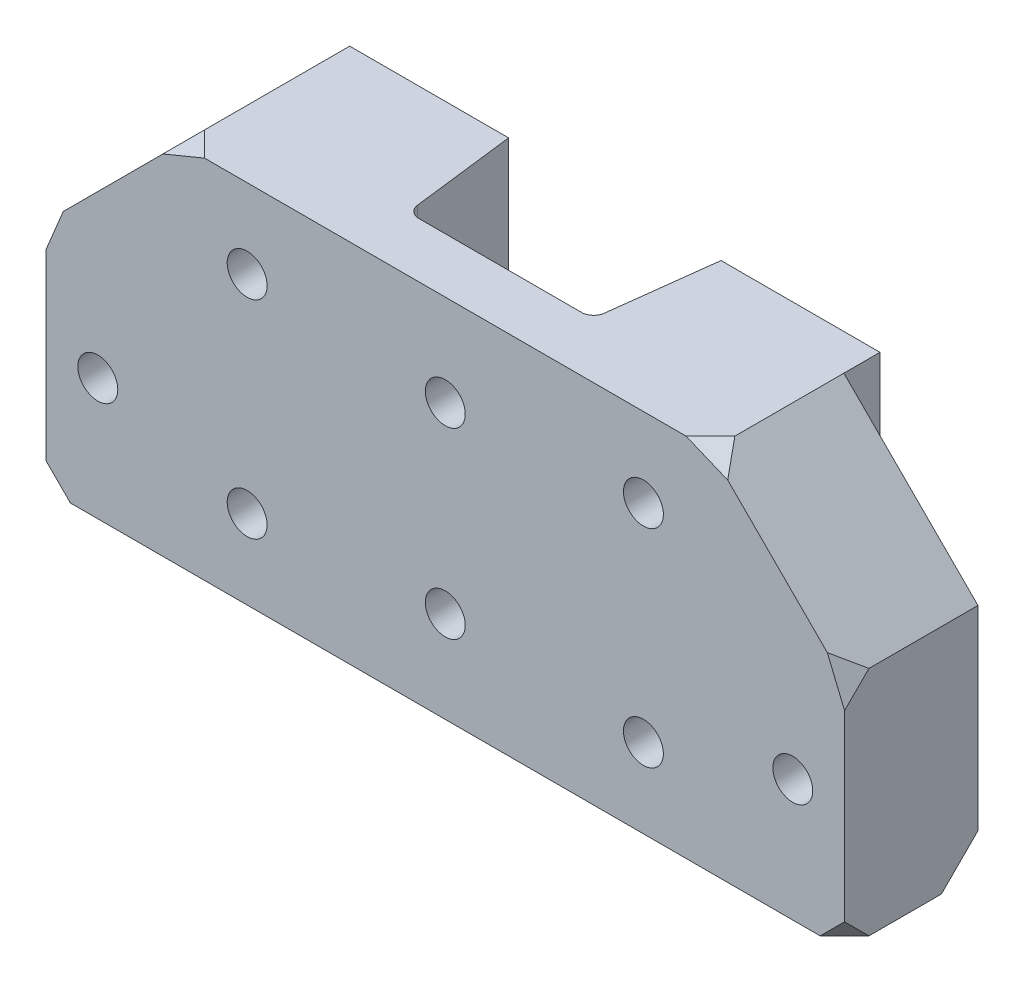
ISO-10303-21;
HEADER;
FILE_DESCRIPTION(('STEP AP214'),'2;1');
FILE_NAME('part.step','',(''),(''),'','','');
FILE_SCHEMA(('AUTOMOTIVE_DESIGN { 1 0 10303 214 1 1 1 1 }'));
ENDSEC;
DATA;
#1=APPLICATION_CONTEXT('core data for automotive mechanical design processes');
#2=APPLICATION_PROTOCOL_DEFINITION('international standard','automotive_design',2000,#1);
#3=PRODUCT_CONTEXT('',#1,'mechanical');
#4=PRODUCT('Part','Part','',(#3));
#5=PRODUCT_RELATED_PRODUCT_CATEGORY('part','',(#4));
#6=PRODUCT_DEFINITION_FORMATION('','',#4);
#7=PRODUCT_DEFINITION_CONTEXT('part definition',#1,'design');
#8=PRODUCT_DEFINITION('design','',#6,#7);
#9=PRODUCT_DEFINITION_SHAPE('','',#8);
#10=(LENGTH_UNIT() NAMED_UNIT(*) SI_UNIT(.MILLI.,.METRE.));
#11=(NAMED_UNIT(*) PLANE_ANGLE_UNIT() SI_UNIT($,.RADIAN.));
#12=(NAMED_UNIT(*) SI_UNIT($,.STERADIAN.) SOLID_ANGLE_UNIT());
#13=UNCERTAINTY_MEASURE_WITH_UNIT(LENGTH_MEASURE(1.E-05),#10,'distance_accuracy_value','');
#14=(GEOMETRIC_REPRESENTATION_CONTEXT(3) GLOBAL_UNCERTAINTY_ASSIGNED_CONTEXT((#13)) GLOBAL_UNIT_ASSIGNED_CONTEXT((#10,
#11,#12)) REPRESENTATION_CONTEXT('',''));
#15=CARTESIAN_POINT('',(0.,0.,0.));
#16=DIRECTION('',(0.,0.,1.));
#17=DIRECTION('',(1.,0.,0.));
#18=AXIS2_PLACEMENT_3D('',#15,#16,#17);
#19=CARTESIAN_POINT('',(84.1301615680965,38.,0.));
#20=DIRECTION('',(-0.707106781186547,-0.707106781186549,0.));
#21=DIRECTION('',(0.,0.,1.));
#22=AXIS2_PLACEMENT_3D('',#19,#20,#21);
#23=PLANE('',#22);
#24=DIRECTION('',(0.,0.,-1.));
#25=VECTOR('',#24,1.);
#26=CARTESIAN_POINT('',(62.1301615680964,60.,0.));
#27=LINE('',#26,#25);
#28=CARTESIAN_POINT('',(62.1301615680964,60.,33.626294368543));
#29=VERTEX_POINT('',#28);
#30=CARTESIAN_POINT('',(62.1301615680965,60.,15.7381471842715));
#31=VERTEX_POINT('',#30);
#32=EDGE_CURVE('E199',#29,#31,#27,.T.);
#33=ORIENTED_EDGE('',*,*,#32,.F.);
#34=DIRECTION('',(-0.5,0.499999999999999,-0.707106781186549));
#35=VECTOR('',#34,1.);
#36=CARTESIAN_POINT('',(61.2414711810105,60.8886903870859,32.3694963703755));
#37=LINE('',#36,#35);
#38=CARTESIAN_POINT('',(64.9585886928426,57.1715728752538,37.6262943685429));
#39=VERTEX_POINT('',#38);
#40=EDGE_CURVE('E11',#29,#39,#37,.F.);
#41=ORIENTED_EDGE('',*,*,#40,.T.);
#42=DIRECTION('',(0.707106781186549,-0.707106781186547,0.));
#43=VECTOR('',#42,1.);
#44=CARTESIAN_POINT('',(61.0650807840481,61.0650807840483,37.6262943685429));
#45=LINE('',#44,#43);
#46=CARTESIAN_POINT('',(81.3017344433502,40.8284271247462,37.6262943685429));
#47=VERTEX_POINT('',#46);
#48=EDGE_CURVE('E212',#47,#39,#45,.F.);
#49=ORIENTED_EDGE('',*,*,#48,.F.);
#50=DIRECTION('',(0.5,-0.499999999999999,-0.707106781186548));
#51=VECTOR('',#50,1.);
#52=CARTESIAN_POINT('',(96.0188519551823,26.1113096129142,16.8131471842714));
#53=LINE('',#52,#51);
#54=CARTESIAN_POINT('',(84.1301615680965,38.,33.6262943685429));
#55=VERTEX_POINT('',#54);
#56=EDGE_CURVE('E260',#55,#47,#53,.F.);
#57=ORIENTED_EDGE('',*,*,#56,.F.);
#58=DIRECTION('',(0.,0.,1.));
#59=VECTOR('',#58,1.);
#60=CARTESIAN_POINT('',(84.1301615680965,38.,0.));
#61=LINE('',#60,#59);
#62=CARTESIAN_POINT('',(84.1301615680965,38.,15.7381471842715));
#63=VERTEX_POINT('',#62);
#64=EDGE_CURVE('E226',#63,#55,#61,.T.);
#65=ORIENTED_EDGE('',*,*,#64,.F.);
#66=DIRECTION('',(-0.707106781186549,0.707106781186547,0.));
#67=VECTOR('',#66,1.);
#68=CARTESIAN_POINT('',(84.1301615680965,38.,15.7381471842715));
#69=LINE('',#68,#67);
#70=EDGE_CURVE('E207',#31,#63,#69,.F.);
#71=ORIENTED_EDGE('',*,*,#70,.F.);
#72=EDGE_LOOP('',(#33,#41,#49,#57,#65,#71));
#73=FACE_BOUND('',#72,.T.);
#74=ADVANCED_FACE('F40',(#73),#23,.F.);
#75=CARTESIAN_POINT('',(0.,0.,37.6262943685429));
#76=DIRECTION('',(0.,0.,1.));
#77=DIRECTION('',(1.,0.,0.));
#78=AXIS2_PLACEMENT_3D('',#75,#76,#77);
#79=PLANE('',#78);
#80=CARTESIAN_POINT('',(-38.3698384319035,20.,37.6262943685429));
#81=DIRECTION('',(0.,0.,1.));
#82=DIRECTION('',(1.,0.,0.));
#83=AXIS2_PLACEMENT_3D('',#80,#81,#82);
#84=CIRCLE('',#83,3.27500000000001);
#85=CARTESIAN_POINT('',(-35.0948384319035,20.,37.6262943685429));
#86=VERTEX_POINT('',#85);
#87=EDGE_CURVE('E547',#86,#86,#84,.T.);
#88=ORIENTED_EDGE('',*,*,#87,.F.);
#89=EDGE_LOOP('',(#88));
#90=FACE_BOUND('',#89,.T.);
#91=CARTESIAN_POINT('',(75.6301615680965,20.,37.6262943685429));
#92=DIRECTION('',(0.,0.,-1.));
#93=DIRECTION('',(-1.,0.,0.));
#94=AXIS2_PLACEMENT_3D('',#91,#92,#93);
#95=CIRCLE('',#94,3.27500000000001);
#96=CARTESIAN_POINT('',(72.3551615680965,20.,37.6262943685429));
#97=VERTEX_POINT('',#96);
#98=EDGE_CURVE('E491',#97,#97,#95,.T.);
#99=ORIENTED_EDGE('',*,*,#98,.T.);
#100=EDGE_LOOP('',(#99));
#101=FACE_BOUND('',#100,.T.);
#102=CARTESIAN_POINT('',(18.6301615680965,45.,37.6262943685429));
#103=DIRECTION('',(0.,0.,1.));
#104=DIRECTION('',(1.,0.,0.));
#105=AXIS2_PLACEMENT_3D('',#102,#103,#104);
#106=CIRCLE('',#105,3.275);
#107=CARTESIAN_POINT('',(21.9051615680965,45.,37.6262943685429));
#108=VERTEX_POINT('',#107);
#109=EDGE_CURVE('E503',#108,#108,#106,.T.);
#110=ORIENTED_EDGE('',*,*,#109,.F.);
#111=EDGE_LOOP('',(#110));
#112=FACE_BOUND('',#111,.T.);
#113=CARTESIAN_POINT('',(18.6301615680965,15.,37.6262943685429));
#114=DIRECTION('',(0.,0.,1.));
#115=DIRECTION('',(1.,0.,0.));
#116=AXIS2_PLACEMENT_3D('',#113,#114,#115);
#117=CIRCLE('',#116,3.275);
#118=CARTESIAN_POINT('',(21.9051615680965,15.,37.6262943685429));
#119=VERTEX_POINT('',#118);
#120=EDGE_CURVE('E502',#119,#119,#117,.T.);
#121=ORIENTED_EDGE('',*,*,#120,.F.);
#122=EDGE_LOOP('',(#121));
#123=FACE_BOUND('',#122,.T.);
#124=CARTESIAN_POINT('',(51.1301615680965,47.,37.6262943685429));
#125=DIRECTION('',(0.,0.,1.));
#126=DIRECTION('',(1.,0.,0.));
#127=AXIS2_PLACEMENT_3D('',#124,#125,#126);
#128=CIRCLE('',#127,3.275);
#129=CARTESIAN_POINT('',(54.4051615680965,47.,37.6262943685429));
#130=VERTEX_POINT('',#129);
#131=EDGE_CURVE('E517',#130,#130,#128,.T.);
#132=ORIENTED_EDGE('',*,*,#131,.F.);
#133=EDGE_LOOP('',(#132));
#134=FACE_BOUND('',#133,.T.);
#135=CARTESIAN_POINT('',(-13.8698384319035,47.,37.6262943685429));
#136=DIRECTION('',(0.,0.,1.));
#137=DIRECTION('',(1.,0.,0.));
#138=AXIS2_PLACEMENT_3D('',#135,#136,#137);
#139=CIRCLE('',#138,3.275);
#140=CARTESIAN_POINT('',(-10.5948384319035,47.,37.6262943685429));
#141=VERTEX_POINT('',#140);
#142=EDGE_CURVE('E523',#141,#141,#139,.T.);
#143=ORIENTED_EDGE('',*,*,#142,.F.);
#144=EDGE_LOOP('',(#143));
#145=FACE_BOUND('',#144,.T.);
#146=CARTESIAN_POINT('',(-13.8698384319035,13.,37.6262943685429));
#147=DIRECTION('',(0.,0.,1.));
#148=DIRECTION('',(1.,0.,0.));
#149=AXIS2_PLACEMENT_3D('',#146,#147,#148);
#150=CIRCLE('',#149,3.275);
#151=CARTESIAN_POINT('',(-10.5948384319035,13.,37.6262943685429));
#152=VERTEX_POINT('',#151);
#153=EDGE_CURVE('E520',#152,#152,#150,.T.);
#154=ORIENTED_EDGE('',*,*,#153,.F.);
#155=EDGE_LOOP('',(#154));
#156=FACE_BOUND('',#155,.T.);
#157=CARTESIAN_POINT('',(51.1301615680965,13.,37.6262943685429));
#158=DIRECTION('',(0.,0.,1.));
#159=DIRECTION('',(1.,0.,0.));
#160=AXIS2_PLACEMENT_3D('',#157,#158,#159);
#161=CIRCLE('',#160,3.275);
#162=CARTESIAN_POINT('',(54.4051615680965,13.,37.6262943685429));
#163=VERTEX_POINT('',#162);
#164=EDGE_CURVE('E514',#163,#163,#161,.T.);
#165=ORIENTED_EDGE('',*,*,#164,.F.);
#166=EDGE_LOOP('',(#165));
#167=FACE_BOUND('',#166,.T.);
#168=ORIENTED_EDGE('',*,*,#48,.T.);
#169=DIRECTION('',(-0.923879532511287,0.382683432365089,0.));
#170=VECTOR('',#169,1.);
#171=CARTESIAN_POINT('',(29.7261685015092,71.7653191537318,37.6262943685429));
#172=LINE('',#171,#170);
#173=CARTESIAN_POINT('',(58.1301615680964,60.,37.6262943685429));
#174=VERTEX_POINT('',#173);
#175=EDGE_CURVE('E48',#39,#174,#172,.T.);
#176=ORIENTED_EDGE('',*,*,#175,.T.);
#177=DIRECTION('',(-1.,0.,0.));
#178=VECTOR('',#177,1.);
#179=CARTESIAN_POINT('',(62.1301615680965,60.,37.6262943685429));
#180=LINE('',#179,#178);
#181=CARTESIAN_POINT('',(-20.8698384319036,60.,37.6262943685429));
#182=VERTEX_POINT('',#181);
#183=EDGE_CURVE('E60',#174,#182,#180,.T.);
#184=ORIENTED_EDGE('',*,*,#183,.T.);
#185=DIRECTION('',(0.923879532511287,0.38268343236509,0.));
#186=VECTOR('',#185,1.);
#187=CARTESIAN_POINT('',(-24.2695205128149,58.5918055743298,37.6262943685429));
#188=LINE('',#187,#186);
#189=CARTESIAN_POINT('',(-27.6982655566497,57.1715728752538,37.6262943685429));
#190=VERTEX_POINT('',#189);
#191=EDGE_CURVE('E281',#190,#182,#188,.T.);
#192=ORIENTED_EDGE('',*,*,#191,.F.);
#193=DIRECTION('',(0.707106781186547,0.707106781186548,0.));
#194=VECTOR('',#193,1.);
#195=CARTESIAN_POINT('',(-42.4349192159518,42.4349192159517,37.6262943685429));
#196=LINE('',#195,#194);
#197=CARTESIAN_POINT('',(-44.0414113071573,40.8284271247462,37.6262943685429));
#198=VERTEX_POINT('',#197);
#199=EDGE_CURVE('E219',#190,#198,#196,.F.);
#200=ORIENTED_EDGE('',*,*,#199,.T.);
#201=DIRECTION('',(-0.382683432365089,-0.923879532511287,0.));
#202=VECTOR('',#201,1.);
#203=CARTESIAN_POINT('',(-52.0267247902815,21.550175013987,37.6262943685429));
#204=LINE('',#203,#202);
#205=CARTESIAN_POINT('',(-46.8698384319035,34.,37.6262943685429));
#206=VERTEX_POINT('',#205);
#207=EDGE_CURVE('E247',#198,#206,#204,.T.);
#208=ORIENTED_EDGE('',*,*,#207,.T.);
#209=DIRECTION('',(0.,-1.,0.));
#210=VECTOR('',#209,1.);
#211=CARTESIAN_POINT('',(-46.8698384319035,0.,37.6262943685429));
#212=LINE('',#211,#210);
#213=CARTESIAN_POINT('',(-46.8698384319035,3.99999999999999,37.6262943685429));
#214=VERTEX_POINT('',#213);
#215=EDGE_CURVE('E546',#206,#214,#212,.T.);
#216=ORIENTED_EDGE('',*,*,#215,.T.);
#217=DIRECTION('',(0.707106781186548,-0.707106781186547,0.));
#218=VECTOR('',#217,1.);
#219=CARTESIAN_POINT('',(-21.4349192159518,-21.4349192159518,37.6262943685429));
#220=LINE('',#219,#218);
#221=CARTESIAN_POINT('',(-42.8698384319035,0.,37.6262943685429));
#222=VERTEX_POINT('',#221);
#223=EDGE_CURVE('E239',#214,#222,#220,.T.);
#224=ORIENTED_EDGE('',*,*,#223,.T.);
#225=DIRECTION('',(1.,0.,0.));
#226=VECTOR('',#225,1.);
#227=CARTESIAN_POINT('',(-24.8698384319035,0.,37.6262943685429));
#228=LINE('',#227,#226);
#229=CARTESIAN_POINT('',(80.1301615680965,0.,37.6262943685429));
#230=VERTEX_POINT('',#229);
#231=EDGE_CURVE('E526',#222,#230,#228,.T.);
#232=ORIENTED_EDGE('',*,*,#231,.T.);
#233=DIRECTION('',(0.707106781186548,0.707106781186547,0.));
#234=VECTOR('',#233,1.);
#235=CARTESIAN_POINT('',(40.0650807840482,-40.0650807840482,37.6262943685429));
#236=LINE('',#235,#234);
#237=CARTESIAN_POINT('',(84.1301615680965,4.00000000000002,37.626294368543));
#238=VERTEX_POINT('',#237);
#239=EDGE_CURVE('E233',#230,#238,#236,.T.);
#240=ORIENTED_EDGE('',*,*,#239,.T.);
#241=DIRECTION('',(0.,-1.,0.));
#242=VECTOR('',#241,1.);
#243=CARTESIAN_POINT('',(84.1301615680965,0.,37.6262943685429));
#244=LINE('',#243,#242);
#245=CARTESIAN_POINT('',(84.1301615680965,34.,37.6262943685429));
#246=VERTEX_POINT('',#245);
#247=EDGE_CURVE('E490',#246,#238,#244,.T.);
#248=ORIENTED_EDGE('',*,*,#247,.F.);
#249=DIRECTION('',(0.38268343236509,-0.923879532511287,0.));
#250=VECTOR('',#249,1.);
#251=CARTESIAN_POINT('',(83.83039993778,34.7236885933891,37.6262943685429));
#252=LINE('',#251,#250);
#253=EDGE_CURVE('E255',#47,#246,#252,.T.);
#254=ORIENTED_EDGE('',*,*,#253,.F.);
#255=EDGE_LOOP('',(#168,#176,#184,#192,#200,#208,#216,#224,#232,#240,#248,#254));
#256=FACE_BOUND('',#255,.T.);
#257=ADVANCED_FACE('F283',(#90,#101,#112,#123,#134,#145,#156,#167,#256),#79,.T.);
#258=CARTESIAN_POINT('',(0.,60.,0.));
#259=DIRECTION('',(0.,-1.,0.));
#260=DIRECTION('',(0.,0.,-1.));
#261=AXIS2_PLACEMENT_3D('',#258,#259,#260);
#262=PLANE('',#261);
#263=DIRECTION('',(-0.707106781186548,0.,0.707106781186548));
#264=VECTOR('',#263,1.);
#265=CARTESIAN_POINT('',(47.8782279683197,60.,47.8782279683197));
#266=LINE('',#265,#264);
#267=EDGE_CURVE('E193',#29,#174,#266,.T.);
#268=ORIENTED_EDGE('',*,*,#267,.F.);
#269=ORIENTED_EDGE('',*,*,#32,.T.);
#270=DIRECTION('',(0.,0.,-1.));
#271=VECTOR('',#270,1.);
#272=CARTESIAN_POINT('',(62.1301615680965,60.,95.5324756032248));
#273=LINE('',#272,#271);
#274=CARTESIAN_POINT('',(62.1301615680965,60.,9.81314718427147));
#275=VERTEX_POINT('',#274);
#276=EDGE_CURVE('E415',#31,#275,#273,.T.);
#277=ORIENTED_EDGE('',*,*,#276,.T.);
#278=DIRECTION('',(1.,0.,0.));
#279=VECTOR('',#278,1.);
#280=CARTESIAN_POINT('',(-2.86983843190352,60.,9.81314718427147));
#281=LINE('',#280,#279);
#282=CARTESIAN_POINT('',(36.0554201680968,60.,9.81314718427147));
#283=VERTEX_POINT('',#282);
#284=EDGE_CURVE('E418',#283,#275,#281,.T.);
#285=ORIENTED_EDGE('',*,*,#284,.F.);
#286=DIRECTION('',(-0.121869343405151,0.,0.992546151641322));
#287=VECTOR('',#286,1.);
#288=CARTESIAN_POINT('',(36.970576623517,60.0000000000001,2.35979597553153));
#289=LINE('',#288,#287);
#290=CARTESIAN_POINT('',(33.961097926045,60.0000000000001,26.8700330553532));
#291=VERTEX_POINT('',#290);
#292=EDGE_CURVE('E439',#283,#291,#289,.T.);
#293=ORIENTED_EDGE('',*,*,#292,.T.);
#294=CARTESIAN_POINT('',(31.9760056227623,60.0000000000001,26.6262943685429));
#295=DIRECTION('',(0.,-1.,0.));
#296=DIRECTION('',(0.,0.,-1.));
#297=AXIS2_PLACEMENT_3D('',#294,#295,#296);
#298=CIRCLE('',#297,2.);
#299=CARTESIAN_POINT('',(31.9760056227623,60.0000000000001,28.626294368543));
#300=VERTEX_POINT('',#299);
#301=EDGE_CURVE('E441',#291,#300,#298,.T.);
#302=ORIENTED_EDGE('',*,*,#301,.T.);
#303=DIRECTION('',(-1.,0.,0.));
#304=VECTOR('',#303,1.);
#305=CARTESIAN_POINT('',(5.28431751343065,60.0000000000001,28.6262943685429));
#306=LINE('',#305,#304);
#307=CARTESIAN_POINT('',(5.28431751343065,60.0000000000001,28.6262943685429));
#308=VERTEX_POINT('',#307);
#309=EDGE_CURVE('E444',#300,#308,#306,.T.);
#310=ORIENTED_EDGE('',*,*,#309,.T.);
#311=CARTESIAN_POINT('',(5.28431751343064,60.0000000000001,26.6262943685429));
#312=DIRECTION('',(0.,-1.,0.));
#313=DIRECTION('',(0.,0.,-1.));
#314=AXIS2_PLACEMENT_3D('',#311,#312,#313);
#315=CIRCLE('',#314,2.);
#316=CARTESIAN_POINT('',(3.29922521014799,60.0000000000001,26.8700330553532));
#317=VERTEX_POINT('',#316);
#318=EDGE_CURVE('E447',#308,#317,#315,.T.);
#319=ORIENTED_EDGE('',*,*,#318,.T.);
#320=DIRECTION('',(-0.121869343405144,0.,-0.992546151641323));
#321=VECTOR('',#320,1.);
#322=CARTESIAN_POINT('',(0.298191513608607,60.0000000000001,2.42857498871066));
#323=LINE('',#322,#321);
#324=CARTESIAN_POINT('',(1.20490296809632,60.0000000000001,9.81314718427148));
#325=VERTEX_POINT('',#324);
#326=EDGE_CURVE('E450',#317,#325,#323,.T.);
#327=ORIENTED_EDGE('',*,*,#326,.T.);
#328=CARTESIAN_POINT('',(-24.8698384319035,60.,9.81314718427147));
#329=VERTEX_POINT('',#328);
#330=EDGE_CURVE('E395',#329,#325,#281,.T.);
#331=ORIENTED_EDGE('',*,*,#330,.F.);
#332=DIRECTION('',(0.,0.,-1.));
#333=VECTOR('',#332,1.);
#334=CARTESIAN_POINT('',(-24.8698384319035,60.,95.5324756032248));
#335=LINE('',#334,#333);
#336=CARTESIAN_POINT('',(-24.8698384319035,60.,15.7381471842715));
#337=VERTEX_POINT('',#336);
#338=EDGE_CURVE('E393',#337,#329,#335,.T.);
#339=ORIENTED_EDGE('',*,*,#338,.F.);
#340=DIRECTION('',(0.,0.,1.));
#341=VECTOR('',#340,1.);
#342=CARTESIAN_POINT('',(-24.8698384319035,60.,0.));
#343=LINE('',#342,#341);
#344=CARTESIAN_POINT('',(-24.8698384319035,60.,33.626294368543));
#345=VERTEX_POINT('',#344);
#346=EDGE_CURVE('E208',#337,#345,#343,.T.);
#347=ORIENTED_EDGE('',*,*,#346,.T.);
#348=DIRECTION('',(0.707106781186548,0.,0.707106781186547));
#349=VECTOR('',#348,1.);
#350=CARTESIAN_POINT('',(-29.2480664002233,60.,29.2480664002233));
#351=LINE('',#350,#349);
#352=EDGE_CURVE('E202',#345,#182,#351,.T.);
#353=ORIENTED_EDGE('',*,*,#352,.T.);
#354=ORIENTED_EDGE('',*,*,#183,.F.);
#355=EDGE_LOOP('',(#268,#269,#277,#285,#293,#302,#310,#319,#327,#331,#339,#347,#353,#354));
#356=FACE_BOUND('',#355,.T.);
#357=ADVANCED_FACE('F198',(#356),#262,.F.);
#358=CARTESIAN_POINT('',(-46.8698384319035,0.,15.7381471842715));
#359=DIRECTION('',(0.,0.,-1.));
#360=DIRECTION('',(-1.,0.,0.));
#361=AXIS2_PLACEMENT_3D('',#358,#359,#360);
#362=PLANE('',#361);
#363=CARTESIAN_POINT('',(-38.3698384319035,20.,15.7381471842715));
#364=DIRECTION('',(0.,0.,1.));
#365=DIRECTION('',(1.,0.,0.));
#366=AXIS2_PLACEMENT_3D('',#363,#364,#365);
#367=CIRCLE('',#366,3.27500000000001);
#368=CARTESIAN_POINT('',(-35.0948384319035,20.,15.7381471842715));
#369=VERTEX_POINT('',#368);
#370=EDGE_CURVE('E552',#369,#369,#367,.T.);
#371=ORIENTED_EDGE('',*,*,#370,.T.);
#372=EDGE_LOOP('',(#371));
#373=FACE_BOUND('',#372,.T.);
#374=DIRECTION('',(1.,0.,0.));
#375=VECTOR('',#374,1.);
#376=CARTESIAN_POINT('',(-46.8698384319035,0.,15.7381471842715));
#377=LINE('',#376,#375);
#378=CARTESIAN_POINT('',(-40.8698384319035,0.,15.7381471842715));
#379=VERTEX_POINT('',#378);
#380=CARTESIAN_POINT('',(-24.8698384319035,0.,15.7381471842715));
#381=VERTEX_POINT('',#380);
#382=EDGE_CURVE('E540',#379,#381,#377,.T.);
#383=ORIENTED_EDGE('',*,*,#382,.F.);
#384=DIRECTION('',(-0.707106781186547,0.707106781186548,0.));
#385=VECTOR('',#384,1.);
#386=CARTESIAN_POINT('',(-43.8698384319035,3.00000000000002,15.7381471842715));
#387=LINE('',#386,#385);
#388=CARTESIAN_POINT('',(-46.8698384319035,6.00000000000002,15.7381471842715));
#389=VERTEX_POINT('',#388);
#390=EDGE_CURVE('E273',#379,#389,#387,.T.);
#391=ORIENTED_EDGE('',*,*,#390,.T.);
#392=DIRECTION('',(0.,1.,0.));
#393=VECTOR('',#392,1.);
#394=CARTESIAN_POINT('',(-46.8698384319035,0.,15.7381471842715));
#395=LINE('',#394,#393);
#396=CARTESIAN_POINT('',(-46.8698384319035,38.,15.7381471842715));
#397=VERTEX_POINT('',#396);
#398=EDGE_CURVE('E549',#389,#397,#395,.T.);
#399=ORIENTED_EDGE('',*,*,#398,.T.);
#400=DIRECTION('',(-0.707106781186547,-0.707106781186548,0.));
#401=VECTOR('',#400,1.);
#402=CARTESIAN_POINT('',(-65.8698384319035,19.,15.7381471842715));
#403=LINE('',#402,#401);
#404=EDGE_CURVE('E224',#397,#337,#403,.F.);
#405=ORIENTED_EDGE('',*,*,#404,.T.);
#406=DIRECTION('',(0.,1.,0.));
#407=VECTOR('',#406,1.);
#408=CARTESIAN_POINT('',(-24.8698384319035,0.,15.7381471842715));
#409=LINE('',#408,#407);
#410=EDGE_CURVE('E538',#381,#337,#409,.T.);
#411=ORIENTED_EDGE('',*,*,#410,.F.);
#412=EDGE_LOOP('',(#383,#391,#399,#405,#411));
#413=FACE_BOUND('',#412,.T.);
#414=ADVANCED_FACE('F316',(#373,#413),#362,.T.);
#415=CARTESIAN_POINT('',(12.657693959334,0.,2.96357615590343));
#416=DIRECTION('',(0.,-1.,0.));
#417=DIRECTION('',(0.,0.,-1.));
#418=AXIS2_PLACEMENT_3D('',#415,#416,#417);
#419=PLANE('',#418);
#420=DIRECTION('',(0.,0.,-1.));
#421=VECTOR('',#420,1.);
#422=CARTESIAN_POINT('',(-46.8698384319035,0.,37.6262943685429));
#423=LINE('',#422,#421);
#424=CARTESIAN_POINT('',(-46.8698384319035,0.,33.626294368543));
#425=VERTEX_POINT('',#424);
#426=CARTESIAN_POINT('',(-46.8698384319035,0.,21.7381471842715));
#427=VERTEX_POINT('',#426);
#428=EDGE_CURVE('E544',#425,#427,#423,.T.);
#429=ORIENTED_EDGE('',*,*,#428,.T.);
#430=DIRECTION('',(0.707106781186548,0.,-0.707106781186548));
#431=VECTOR('',#430,1.);
#432=CARTESIAN_POINT('',(-7.71878672210072,0.,-17.4129045255313));
#433=LINE('',#432,#431);
#434=EDGE_CURVE('E271',#427,#379,#433,.T.);
#435=ORIENTED_EDGE('',*,*,#434,.T.);
#436=ORIENTED_EDGE('',*,*,#382,.T.);
#437=DIRECTION('',(0.,0.,-1.));
#438=VECTOR('',#437,1.);
#439=CARTESIAN_POINT('',(-24.8698384319035,0.,95.5324756032248));
#440=LINE('',#439,#438);
#441=CARTESIAN_POINT('',(-24.8698384319035,0.,9.81314718427147));
#442=VERTEX_POINT('',#441);
#443=EDGE_CURVE('E400',#381,#442,#440,.T.);
#444=ORIENTED_EDGE('',*,*,#443,.T.);
#445=DIRECTION('',(1.,0.,0.));
#446=VECTOR('',#445,1.);
#447=CARTESIAN_POINT('',(-2.86983843190352,0.,9.81314718427147));
#448=LINE('',#447,#446);
#449=CARTESIAN_POINT('',(1.20490296809632,0.,9.81314718427147));
#450=VERTEX_POINT('',#449);
#451=EDGE_CURVE('E420',#442,#450,#448,.T.);
#452=ORIENTED_EDGE('',*,*,#451,.T.);
#453=DIRECTION('',(0.121869343405145,0.,0.992546151641322));
#454=VECTOR('',#453,1.);
#455=CARTESIAN_POINT('',(0.298191513608603,0.,2.42857498871065));
#456=LINE('',#455,#454);
#457=CARTESIAN_POINT('',(3.29922521014799,0.,26.8700330553532));
#458=VERTEX_POINT('',#457);
#459=EDGE_CURVE('E214',#450,#458,#456,.T.);
#460=ORIENTED_EDGE('',*,*,#459,.T.);
#461=CARTESIAN_POINT('',(5.28431751343064,0.,26.6262943685429));
#462=DIRECTION('',(0.,-1.,0.));
#463=DIRECTION('',(0.,0.,-1.));
#464=AXIS2_PLACEMENT_3D('',#461,#462,#463);
#465=CIRCLE('',#464,2.);
#466=CARTESIAN_POINT('',(5.28431751343065,0.,28.6262943685429));
#467=VERTEX_POINT('',#466);
#468=EDGE_CURVE('E461',#458,#467,#465,.F.);
#469=ORIENTED_EDGE('',*,*,#468,.T.);
#470=DIRECTION('',(1.,0.,0.));
#471=VECTOR('',#470,1.);
#472=CARTESIAN_POINT('',(12.657693959334,0.,28.6262943685429));
#473=LINE('',#472,#471);
#474=CARTESIAN_POINT('',(31.9760056227623,0.,28.626294368543));
#475=VERTEX_POINT('',#474);
#476=EDGE_CURVE('E458',#467,#475,#473,.T.);
#477=ORIENTED_EDGE('',*,*,#476,.T.);
#478=CARTESIAN_POINT('',(31.9760056227623,0.,26.6262943685429));
#479=DIRECTION('',(0.,-1.,0.));
#480=DIRECTION('',(0.,0.,-1.));
#481=AXIS2_PLACEMENT_3D('',#478,#479,#480);
#482=CIRCLE('',#481,2.00000000000001);
#483=CARTESIAN_POINT('',(33.961097926045,0.,26.8700330553532));
#484=VERTEX_POINT('',#483);
#485=EDGE_CURVE('E455',#475,#484,#482,.F.);
#486=ORIENTED_EDGE('',*,*,#485,.T.);
#487=DIRECTION('',(0.121869343405151,0.,-0.992546151641322));
#488=VECTOR('',#487,1.);
#489=CARTESIAN_POINT('',(33.961097926045,0.,26.8700330553533));
#490=LINE('',#489,#488);
#491=CARTESIAN_POINT('',(36.0554201680968,0.,9.81314718427147));
#492=VERTEX_POINT('',#491);
#493=EDGE_CURVE('E452',#484,#492,#490,.T.);
#494=ORIENTED_EDGE('',*,*,#493,.T.);
#495=CARTESIAN_POINT('',(62.1301615680965,0.,9.81314718427147));
#496=VERTEX_POINT('',#495);
#497=EDGE_CURVE('E424',#492,#496,#448,.T.);
#498=ORIENTED_EDGE('',*,*,#497,.T.);
#499=DIRECTION('',(0.,0.,-1.));
#500=VECTOR('',#499,1.);
#501=CARTESIAN_POINT('',(62.1301615680965,0.,95.5324756032248));
#502=LINE('',#501,#500);
#503=CARTESIAN_POINT('',(62.1301615680965,0.,15.7381471842715));
#504=VERTEX_POINT('',#503);
#505=EDGE_CURVE('E416',#504,#496,#502,.T.);
#506=ORIENTED_EDGE('',*,*,#505,.F.);
#507=DIRECTION('',(-1.,0.,0.));
#508=VECTOR('',#507,1.);
#509=CARTESIAN_POINT('',(84.1301615680965,0.,15.7381471842715));
#510=LINE('',#509,#508);
#511=CARTESIAN_POINT('',(78.1301615680965,0.,15.7381471842715));
#512=VERTEX_POINT('',#511);
#513=EDGE_CURVE('E489',#512,#504,#510,.T.);
#514=ORIENTED_EDGE('',*,*,#513,.F.);
#515=DIRECTION('',(0.707106781186548,0.,0.707106781186547));
#516=VECTOR('',#515,1.);
#517=CARTESIAN_POINT('',(39.0066422495311,0.,-23.3853721342938));
#518=LINE('',#517,#516);
#519=CARTESIAN_POINT('',(84.1301615680965,0.,21.7381471842715));
#520=VERTEX_POINT('',#519);
#521=EDGE_CURVE('E266',#512,#520,#518,.T.);
#522=ORIENTED_EDGE('',*,*,#521,.T.);
#523=DIRECTION('',(0.,0.,-1.));
#524=VECTOR('',#523,1.);
#525=CARTESIAN_POINT('',(84.1301615680965,0.,37.6262943685429));
#526=LINE('',#525,#524);
#527=CARTESIAN_POINT('',(84.1301615680965,0.,33.6262943685429));
#528=VERTEX_POINT('',#527);
#529=EDGE_CURVE('E493',#528,#520,#526,.T.);
#530=ORIENTED_EDGE('',*,*,#529,.F.);
#531=DIRECTION('',(-0.707106781186548,0.,0.707106781186547));
#532=VECTOR('',#531,1.);
#533=CARTESIAN_POINT('',(63.7252868700349,0.,54.0311690666044));
#534=LINE('',#533,#532);
#535=EDGE_CURVE('E230',#528,#230,#534,.T.);
#536=ORIENTED_EDGE('',*,*,#535,.T.);
#537=ORIENTED_EDGE('',*,*,#231,.F.);
#538=DIRECTION('',(-0.707106781186548,0.,-0.707106781186547));
#539=VECTOR('',#538,1.);
#540=CARTESIAN_POINT('',(-32.4374313426045,0.,48.058701457842));
#541=LINE('',#540,#539);
#542=EDGE_CURVE('E241',#222,#425,#541,.T.);
#543=ORIENTED_EDGE('',*,*,#542,.T.);
#544=EDGE_LOOP('',(#429,#435,#436,#444,#452,#460,#469,#477,#486,#494,#498,#506,#514,#522,#530,
#536,#537,#543));
#545=FACE_BOUND('',#544,.T.);
#546=ADVANCED_FACE('F374',(#545),#419,.T.);
#547=CARTESIAN_POINT('',(84.1301615680965,0.,0.));
#548=DIRECTION('',(-1.,0.,0.));
#549=DIRECTION('',(0.,0.,1.));
#550=AXIS2_PLACEMENT_3D('',#547,#548,#549);
#551=PLANE('',#550);
#552=DIRECTION('',(0.,-0.707106781186548,0.707106781186547));
#553=VECTOR('',#552,1.);
#554=CARTESIAN_POINT('',(84.1301615680965,10.8690735921357,10.8690735921357));
#555=LINE('',#554,#553);
#556=CARTESIAN_POINT('',(84.1301615680965,6.,15.7381471842715));
#557=VERTEX_POINT('',#556);
#558=EDGE_CURVE('E263',#557,#520,#555,.T.);
#559=ORIENTED_EDGE('',*,*,#558,.F.);
#560=DIRECTION('',(0.,1.,0.));
#561=VECTOR('',#560,1.);
#562=CARTESIAN_POINT('',(84.1301615680965,0.,15.7381471842715));
#563=LINE('',#562,#561);
#564=EDGE_CURVE('E291',#557,#63,#563,.T.);
#565=ORIENTED_EDGE('',*,*,#564,.T.);
#566=ORIENTED_EDGE('',*,*,#64,.T.);
#567=DIRECTION('',(0.,-0.707106781186548,0.707106781186547));
#568=VECTOR('',#567,1.);
#569=CARTESIAN_POINT('',(84.1301615680965,35.8131471842714,35.8131471842715));
#570=LINE('',#569,#568);
#571=EDGE_CURVE('E258',#55,#246,#570,.T.);
#572=ORIENTED_EDGE('',*,*,#571,.T.);
#573=ORIENTED_EDGE('',*,*,#247,.T.);
#574=DIRECTION('',(0.,0.707106781186548,0.707106781186547));
#575=VECTOR('',#574,1.);
#576=CARTESIAN_POINT('',(84.1301615680965,-16.8131471842715,16.8131471842715));
#577=LINE('',#576,#575);
#578=EDGE_CURVE('E236',#528,#238,#577,.T.);
#579=ORIENTED_EDGE('',*,*,#578,.F.);
#580=ORIENTED_EDGE('',*,*,#529,.T.);
#581=EDGE_LOOP('',(#559,#565,#566,#572,#573,#579,#580));
#582=FACE_BOUND('',#581,.T.);
#583=ADVANCED_FACE('F290',(#582),#551,.F.);
#584=CARTESIAN_POINT('',(-24.8698384319035,60.,0.));
#585=DIRECTION('',(0.707106781186548,-0.707106781186547,0.));
#586=DIRECTION('',(0.,0.,1.));
#587=AXIS2_PLACEMENT_3D('',#584,#585,#586);
#588=PLANE('',#587);
#589=DIRECTION('',(0.499999999999999,0.5,-0.707106781186548));
#590=VECTOR('',#589,1.);
#591=CARTESIAN_POINT('',(-12.9811480448176,71.8886903870859,16.8131471842715));
#592=LINE('',#591,#590);
#593=EDGE_CURVE('E279',#345,#190,#592,.F.);
#594=ORIENTED_EDGE('',*,*,#593,.F.);
#595=ORIENTED_EDGE('',*,*,#346,.F.);
#596=ORIENTED_EDGE('',*,*,#404,.F.);
#597=DIRECTION('',(0.,0.,-1.));
#598=VECTOR('',#597,1.);
#599=CARTESIAN_POINT('',(-46.8698384319035,38.,0.));
#600=LINE('',#599,#598);
#601=CARTESIAN_POINT('',(-46.8698384319035,38.,33.626294368543));
#602=VERTEX_POINT('',#601);
#603=EDGE_CURVE('E221',#602,#397,#600,.T.);
#604=ORIENTED_EDGE('',*,*,#603,.F.);
#605=DIRECTION('',(-0.499999999999999,-0.5,-0.707106781186548));
#606=VECTOR('',#605,1.);
#607=CARTESIAN_POINT('',(-47.7585288189894,37.1113096129141,32.3694963703755));
#608=LINE('',#607,#606);
#609=EDGE_CURVE('E252',#602,#198,#608,.F.);
#610=ORIENTED_EDGE('',*,*,#609,.T.);
#611=ORIENTED_EDGE('',*,*,#199,.F.);
#612=EDGE_LOOP('',(#594,#595,#596,#604,#610,#611));
#613=FACE_BOUND('',#612,.T.);
#614=ADVANCED_FACE('F337',(#613),#588,.F.);
#615=CARTESIAN_POINT('',(-24.8698384319035,0.,95.5324756032248));
#616=DIRECTION('',(-1.,0.,0.));
#617=DIRECTION('',(0.,-1.,0.));
#618=AXIS2_PLACEMENT_3D('',#615,#616,#617);
#619=PLANE('',#618);
#620=ORIENTED_EDGE('',*,*,#443,.F.);
#621=ORIENTED_EDGE('',*,*,#410,.T.);
#622=ORIENTED_EDGE('',*,*,#338,.T.);
#623=DIRECTION('',(0.,1.,0.));
#624=VECTOR('',#623,1.);
#625=CARTESIAN_POINT('',(-24.8698384319035,0.,9.81314718427147));
#626=LINE('',#625,#624);
#627=EDGE_CURVE('E405',#442,#329,#626,.T.);
#628=ORIENTED_EDGE('',*,*,#627,.F.);
#629=EDGE_LOOP('',(#620,#621,#622,#628));
#630=FACE_BOUND('',#629,.T.);
#631=ADVANCED_FACE('F333',(#630),#619,.T.);
#632=CARTESIAN_POINT('',(0.298191513608605,2133.6,2.42857498871065));
#633=DIRECTION('',(0.992546151641322,0.,-0.121869343405144));
#634=DIRECTION('',(-0.121869343405145,0.,-0.992546151641323));
#635=AXIS2_PLACEMENT_3D('',#632,#633,#634);
#636=PLANE('',#635);
#637=DIRECTION('',(0.,-1.,0.));
#638=VECTOR('',#637,1.);
#639=CARTESIAN_POINT('',(1.20490296809632,2133.6,9.81314718427147));
#640=LINE('',#639,#638);
#641=EDGE_CURVE('E423',#325,#450,#640,.T.);
#642=ORIENTED_EDGE('',*,*,#641,.F.);
#643=ORIENTED_EDGE('',*,*,#326,.F.);
#644=DIRECTION('',(0.,-1.,0.));
#645=VECTOR('',#644,1.);
#646=CARTESIAN_POINT('',(3.29922521014799,2133.6,26.8700330553532));
#647=LINE('',#646,#645);
#648=EDGE_CURVE('E436',#317,#458,#647,.T.);
#649=ORIENTED_EDGE('',*,*,#648,.T.);
#650=ORIENTED_EDGE('',*,*,#459,.F.);
#651=EDGE_LOOP('',(#642,#643,#649,#650));
#652=FACE_BOUND('',#651,.T.);
#653=ADVANCED_FACE('F336',(#652),#636,.T.);
#654=CARTESIAN_POINT('',(5.28431751343064,2133.6,26.6262943685429));
#655=DIRECTION('',(0.,-1.,0.));
#656=DIRECTION('',(0.,0.,-1.));
#657=AXIS2_PLACEMENT_3D('',#654,#655,#656);
#658=CYLINDRICAL_SURFACE('',#657,2.);
#659=ORIENTED_EDGE('',*,*,#318,.F.);
#660=DIRECTION('',(0.,-1.,0.));
#661=VECTOR('',#660,1.);
#662=CARTESIAN_POINT('',(5.28431751343065,2133.6,28.6262943685429));
#663=LINE('',#662,#661);
#664=EDGE_CURVE('E433',#308,#467,#663,.T.);
#665=ORIENTED_EDGE('',*,*,#664,.T.);
#666=ORIENTED_EDGE('',*,*,#468,.F.);
#667=ORIENTED_EDGE('',*,*,#648,.F.);
#668=EDGE_LOOP('',(#659,#665,#666,#667));
#669=FACE_BOUND('',#668,.T.);
#670=ADVANCED_FACE('F366',(#669),#658,.F.);
#671=CARTESIAN_POINT('',(5.28431751343065,2133.6,28.6262943685429));
#672=DIRECTION('',(0.,0.,-1.));
#673=DIRECTION('',(-1.,0.,0.));
#674=AXIS2_PLACEMENT_3D('',#671,#672,#673);
#675=PLANE('',#674);
#676=CARTESIAN_POINT('',(18.6301615680965,45.,28.626294368543));
#677=DIRECTION('',(0.,0.,-1.));
#678=DIRECTION('',(-1.,0.,0.));
#679=AXIS2_PLACEMENT_3D('',#676,#677,#678);
#680=CIRCLE('',#679,3.275);
#681=CARTESIAN_POINT('',(15.3551615680965,45.,28.626294368543));
#682=VERTEX_POINT('',#681);
#683=EDGE_CURVE('E511',#682,#682,#680,.T.);
#684=ORIENTED_EDGE('',*,*,#683,.F.);
#685=EDGE_LOOP('',(#684));
#686=FACE_BOUND('',#685,.T.);
#687=CARTESIAN_POINT('',(18.6301615680965,15.,28.626294368543));
#688=DIRECTION('',(0.,0.,-1.));
#689=DIRECTION('',(-1.,0.,0.));
#690=AXIS2_PLACEMENT_3D('',#687,#688,#689);
#691=CIRCLE('',#690,3.275);
#692=CARTESIAN_POINT('',(15.3551615680965,15.,28.626294368543));
#693=VERTEX_POINT('',#692);
#694=EDGE_CURVE('E506',#693,#693,#691,.T.);
#695=ORIENTED_EDGE('',*,*,#694,.F.);
#696=EDGE_LOOP('',(#695));
#697=FACE_BOUND('',#696,.T.);
#698=ORIENTED_EDGE('',*,*,#309,.F.);
#699=DIRECTION('',(0.,-1.,0.));
#700=VECTOR('',#699,1.);
#701=CARTESIAN_POINT('',(31.9760056227623,2133.6,28.626294368543));
#702=LINE('',#701,#700);
#703=EDGE_CURVE('E430',#300,#475,#702,.T.);
#704=ORIENTED_EDGE('',*,*,#703,.T.);
#705=ORIENTED_EDGE('',*,*,#476,.F.);
#706=ORIENTED_EDGE('',*,*,#664,.F.);
#707=EDGE_LOOP('',(#698,#704,#705,#706));
#708=FACE_BOUND('',#707,.T.);
#709=ADVANCED_FACE('F362',(#686,#697,#708),#675,.T.);
#710=CARTESIAN_POINT('',(31.9760056227623,2133.6,26.6262943685429));
#711=DIRECTION('',(0.,-1.,0.));
#712=DIRECTION('',(0.,0.,-1.));
#713=AXIS2_PLACEMENT_3D('',#710,#711,#712);
#714=CYLINDRICAL_SURFACE('',#713,2.00000000000001);
#715=ORIENTED_EDGE('',*,*,#301,.F.);
#716=DIRECTION('',(0.,-1.,0.));
#717=VECTOR('',#716,1.);
#718=CARTESIAN_POINT('',(33.961097926045,2133.6,26.8700330553532));
#719=LINE('',#718,#717);
#720=EDGE_CURVE('E427',#291,#484,#719,.T.);
#721=ORIENTED_EDGE('',*,*,#720,.T.);
#722=ORIENTED_EDGE('',*,*,#485,.F.);
#723=ORIENTED_EDGE('',*,*,#703,.F.);
#724=EDGE_LOOP('',(#715,#721,#722,#723));
#725=FACE_BOUND('',#724,.T.);
#726=ADVANCED_FACE('F358',(#725),#714,.F.);
#727=CARTESIAN_POINT('',(33.961097926045,2133.6,26.8700330553532));
#728=DIRECTION('',(-0.992546151641322,0.,-0.121869343405151));
#729=DIRECTION('',(-0.121869343405151,0.,0.992546151641322));
#730=AXIS2_PLACEMENT_3D('',#727,#728,#729);
#731=PLANE('',#730);
#732=DIRECTION('',(0.,1.,0.));
#733=VECTOR('',#732,1.);
#734=CARTESIAN_POINT('',(36.0554201680968,2133.6,9.81314718427147));
#735=LINE('',#734,#733);
#736=EDGE_CURVE('E209',#492,#283,#735,.T.);
#737=ORIENTED_EDGE('',*,*,#736,.F.);
#738=ORIENTED_EDGE('',*,*,#493,.F.);
#739=ORIENTED_EDGE('',*,*,#720,.F.);
#740=ORIENTED_EDGE('',*,*,#292,.F.);
#741=EDGE_LOOP('',(#737,#738,#739,#740));
#742=FACE_BOUND('',#741,.T.);
#743=ADVANCED_FACE('F354',(#742),#731,.T.);
#744=CARTESIAN_POINT('',(-2.86983843190352,0.,9.81314718427147));
#745=DIRECTION('',(0.,0.,1.));
#746=DIRECTION('',(1.,0.,0.));
#747=AXIS2_PLACEMENT_3D('',#744,#745,#746);
#748=PLANE('',#747);
#749=ORIENTED_EDGE('',*,*,#736,.T.);
#750=ORIENTED_EDGE('',*,*,#284,.T.);
#751=DIRECTION('',(0.,-1.,0.));
#752=VECTOR('',#751,1.);
#753=CARTESIAN_POINT('',(62.1301615680965,0.,9.81314718427147));
#754=LINE('',#753,#752);
#755=EDGE_CURVE('E412',#275,#496,#754,.T.);
#756=ORIENTED_EDGE('',*,*,#755,.T.);
#757=ORIENTED_EDGE('',*,*,#497,.F.);
#758=EDGE_LOOP('',(#749,#750,#756,#757));
#759=FACE_BOUND('',#758,.T.);
#760=CARTESIAN_POINT('',(51.1301615680965,13.,9.81314718427147));
#761=DIRECTION('',(0.,0.,-1.));
#762=DIRECTION('',(-1.,0.,0.));
#763=AXIS2_PLACEMENT_3D('',#760,#761,#762);
#764=CIRCLE('',#763,3.275);
#765=CARTESIAN_POINT('',(47.8551615680965,13.,9.81314718427147));
#766=VERTEX_POINT('',#765);
#767=EDGE_CURVE('E399',#766,#766,#764,.T.);
#768=ORIENTED_EDGE('',*,*,#767,.F.);
#769=EDGE_LOOP('',(#768));
#770=FACE_BOUND('',#769,.T.);
#771=CARTESIAN_POINT('',(51.1301615680965,47.,9.81314718427147));
#772=DIRECTION('',(0.,0.,-1.));
#773=DIRECTION('',(-1.,0.,0.));
#774=AXIS2_PLACEMENT_3D('',#771,#772,#773);
#775=CIRCLE('',#774,3.275);
#776=CARTESIAN_POINT('',(47.8551615680965,47.,9.81314718427147));
#777=VERTEX_POINT('',#776);
#778=EDGE_CURVE('E403',#777,#777,#775,.T.);
#779=ORIENTED_EDGE('',*,*,#778,.F.);
#780=EDGE_LOOP('',(#779));
#781=FACE_BOUND('',#780,.T.);
#782=ADVANCED_FACE('F351',(#759,#770,#781),#748,.F.);
#783=ORIENTED_EDGE('',*,*,#641,.T.);
#784=ORIENTED_EDGE('',*,*,#451,.F.);
#785=ORIENTED_EDGE('',*,*,#627,.T.);
#786=ORIENTED_EDGE('',*,*,#330,.T.);
#787=EDGE_LOOP('',(#783,#784,#785,#786));
#788=FACE_BOUND('',#787,.T.);
#789=CARTESIAN_POINT('',(-13.8698384319035,47.,9.81314718427147));
#790=DIRECTION('',(0.,0.,-1.));
#791=DIRECTION('',(1.,0.,0.));
#792=AXIS2_PLACEMENT_3D('',#789,#790,#791);
#793=CIRCLE('',#792,3.275);
#794=CARTESIAN_POINT('',(-10.5948384319035,47.,9.81314718427147));
#795=VERTEX_POINT('',#794);
#796=EDGE_CURVE('E529',#795,#795,#793,.T.);
#797=ORIENTED_EDGE('',*,*,#796,.F.);
#798=EDGE_LOOP('',(#797));
#799=FACE_BOUND('',#798,.T.);
#800=CARTESIAN_POINT('',(-13.8698384319035,13.,9.81314718427147));
#801=DIRECTION('',(0.,0.,-1.));
#802=DIRECTION('',(1.,0.,0.));
#803=AXIS2_PLACEMENT_3D('',#800,#801,#802);
#804=CIRCLE('',#803,3.27499999999999);
#805=CARTESIAN_POINT('',(-10.5948384319035,13.,9.81314718427147));
#806=VERTEX_POINT('',#805);
#807=EDGE_CURVE('E531',#806,#806,#804,.T.);
#808=ORIENTED_EDGE('',*,*,#807,.F.);
#809=EDGE_LOOP('',(#808));
#810=FACE_BOUND('',#809,.T.);
#811=ADVANCED_FACE('F349',(#788,#799,#810),#748,.F.);
#812=CARTESIAN_POINT('',(62.1301615680965,0.,95.5324756032248));
#813=DIRECTION('',(1.,0.,0.));
#814=DIRECTION('',(0.,0.,-1.));
#815=AXIS2_PLACEMENT_3D('',#812,#813,#814);
#816=PLANE('',#815);
#817=DIRECTION('',(0.,1.,0.));
#818=VECTOR('',#817,1.);
#819=CARTESIAN_POINT('',(62.1301615680965,0.,15.7381471842715));
#820=LINE('',#819,#818);
#821=EDGE_CURVE('E483',#504,#31,#820,.T.);
#822=ORIENTED_EDGE('',*,*,#821,.F.);
#823=ORIENTED_EDGE('',*,*,#505,.T.);
#824=ORIENTED_EDGE('',*,*,#755,.F.);
#825=ORIENTED_EDGE('',*,*,#276,.F.);
#826=EDGE_LOOP('',(#822,#823,#824,#825));
#827=FACE_BOUND('',#826,.T.);
#828=ADVANCED_FACE('F345',(#827),#816,.T.);
#829=CARTESIAN_POINT('',(51.1301615680965,47.,95.5324756032248));
#830=DIRECTION('',(0.,0.,-1.));
#831=DIRECTION('',(-1.,0.,0.));
#832=AXIS2_PLACEMENT_3D('',#829,#830,#831);
#833=CYLINDRICAL_SURFACE('',#832,3.275);
#834=ORIENTED_EDGE('',*,*,#778,.T.);
#835=EDGE_LOOP('',(#834));
#836=FACE_BOUND('',#835,.T.);
#837=ORIENTED_EDGE('',*,*,#131,.T.);
#838=EDGE_LOOP('',(#837));
#839=FACE_BOUND('',#838,.T.);
#840=ADVANCED_FACE('F341',(#836,#839),#833,.F.);
#841=CARTESIAN_POINT('',(51.1301615680965,13.,95.5324756032248));
#842=DIRECTION('',(0.,0.,-1.));
#843=DIRECTION('',(-1.,0.,0.));
#844=AXIS2_PLACEMENT_3D('',#841,#842,#843);
#845=CYLINDRICAL_SURFACE('',#844,3.275);
#846=ORIENTED_EDGE('',*,*,#767,.T.);
#847=EDGE_LOOP('',(#846));
#848=FACE_BOUND('',#847,.T.);
#849=ORIENTED_EDGE('',*,*,#164,.T.);
#850=EDGE_LOOP('',(#849));
#851=FACE_BOUND('',#850,.T.);
#852=ADVANCED_FACE('F331',(#848,#851),#845,.F.);
#853=CARTESIAN_POINT('',(-13.8698384319035,13.,95.5324756032248));
#854=DIRECTION('',(0.,0.,-1.));
#855=DIRECTION('',(-1.,0.,0.));
#856=AXIS2_PLACEMENT_3D('',#853,#854,#855);
#857=CYLINDRICAL_SURFACE('',#856,3.27499999999999);
#858=ORIENTED_EDGE('',*,*,#807,.T.);
#859=EDGE_LOOP('',(#858));
#860=FACE_BOUND('',#859,.T.);
#861=ORIENTED_EDGE('',*,*,#153,.T.);
#862=EDGE_LOOP('',(#861));
#863=FACE_BOUND('',#862,.T.);
#864=ADVANCED_FACE('F327',(#860,#863),#857,.F.);
#865=CARTESIAN_POINT('',(-13.8698384319035,47.,95.5324756032248));
#866=DIRECTION('',(0.,0.,-1.));
#867=DIRECTION('',(-1.,0.,0.));
#868=AXIS2_PLACEMENT_3D('',#865,#866,#867);
#869=CYLINDRICAL_SURFACE('',#868,3.275);
#870=ORIENTED_EDGE('',*,*,#796,.T.);
#871=EDGE_LOOP('',(#870));
#872=FACE_BOUND('',#871,.T.);
#873=ORIENTED_EDGE('',*,*,#142,.T.);
#874=EDGE_LOOP('',(#873));
#875=FACE_BOUND('',#874,.T.);
#876=ADVANCED_FACE('F324',(#872,#875),#869,.F.);
#877=CARTESIAN_POINT('',(18.6301615680965,15.,9.81314718427147));
#878=DIRECTION('',(0.,0.,1.));
#879=DIRECTION('',(1.,0.,0.));
#880=AXIS2_PLACEMENT_3D('',#877,#878,#879);
#881=CYLINDRICAL_SURFACE('',#880,3.275);
#882=ORIENTED_EDGE('',*,*,#694,.T.);
#883=EDGE_LOOP('',(#882));
#884=FACE_BOUND('',#883,.T.);
#885=ORIENTED_EDGE('',*,*,#120,.T.);
#886=EDGE_LOOP('',(#885));
#887=FACE_BOUND('',#886,.T.);
#888=ADVANCED_FACE('F322',(#884,#887),#881,.F.);
#889=CARTESIAN_POINT('',(18.6301615680965,45.,9.81314718427147));
#890=DIRECTION('',(0.,0.,1.));
#891=DIRECTION('',(1.,0.,0.));
#892=AXIS2_PLACEMENT_3D('',#889,#890,#891);
#893=CYLINDRICAL_SURFACE('',#892,3.275);
#894=ORIENTED_EDGE('',*,*,#683,.T.);
#895=EDGE_LOOP('',(#894));
#896=FACE_BOUND('',#895,.T.);
#897=ORIENTED_EDGE('',*,*,#109,.T.);
#898=EDGE_LOOP('',(#897));
#899=FACE_BOUND('',#898,.T.);
#900=ADVANCED_FACE('F598',(#896,#899),#893,.F.);
#901=CARTESIAN_POINT('',(84.1301615680965,0.,15.7381471842715));
#902=DIRECTION('',(0.,0.,1.));
#903=DIRECTION('',(1.,0.,0.));
#904=AXIS2_PLACEMENT_3D('',#901,#902,#903);
#905=PLANE('',#904);
#906=DIRECTION('',(0.707106781186548,0.707106781186547,0.));
#907=VECTOR('',#906,1.);
#908=CARTESIAN_POINT('',(81.1301615680965,3.,15.7381471842715));
#909=LINE('',#908,#907);
#910=EDGE_CURVE('E268',#512,#557,#909,.T.);
#911=ORIENTED_EDGE('',*,*,#910,.F.);
#912=ORIENTED_EDGE('',*,*,#513,.T.);
#913=ORIENTED_EDGE('',*,*,#821,.T.);
#914=ORIENTED_EDGE('',*,*,#70,.T.);
#915=ORIENTED_EDGE('',*,*,#564,.F.);
#916=EDGE_LOOP('',(#911,#912,#913,#914,#915));
#917=FACE_BOUND('',#916,.T.);
#918=CARTESIAN_POINT('',(75.6301615680965,20.,15.7381471842715));
#919=DIRECTION('',(0.,0.,-1.));
#920=DIRECTION('',(-1.,0.,0.));
#921=AXIS2_PLACEMENT_3D('',#918,#919,#920);
#922=CIRCLE('',#921,3.27500000000001);
#923=CARTESIAN_POINT('',(72.3551615680965,20.,15.7381471842715));
#924=VERTEX_POINT('',#923);
#925=EDGE_CURVE('E496',#924,#924,#922,.T.);
#926=ORIENTED_EDGE('',*,*,#925,.F.);
#927=EDGE_LOOP('',(#926));
#928=FACE_BOUND('',#927,.T.);
#929=ADVANCED_FACE('F486',(#917,#928),#905,.F.);
#930=CARTESIAN_POINT('',(75.6301615680965,20.,37.6262943685429));
#931=DIRECTION('',(0.,0.,-1.));
#932=DIRECTION('',(-1.,0.,0.));
#933=AXIS2_PLACEMENT_3D('',#930,#931,#932);
#934=CYLINDRICAL_SURFACE('',#933,3.27500000000001);
#935=ORIENTED_EDGE('',*,*,#98,.F.);
#936=EDGE_LOOP('',(#935));
#937=FACE_BOUND('',#936,.T.);
#938=ORIENTED_EDGE('',*,*,#925,.T.);
#939=EDGE_LOOP('',(#938));
#940=FACE_BOUND('',#939,.T.);
#941=ADVANCED_FACE('F588',(#937,#940),#934,.F.);
#942=CARTESIAN_POINT('',(-46.8698384319035,0.,0.));
#943=DIRECTION('',(1.,0.,0.));
#944=DIRECTION('',(0.,0.,1.));
#945=AXIS2_PLACEMENT_3D('',#942,#943,#944);
#946=PLANE('',#945);
#947=DIRECTION('',(0.,0.707106781186548,-0.707106781186547));
#948=VECTOR('',#947,1.);
#949=CARTESIAN_POINT('',(-46.8698384319035,10.8690735921358,10.8690735921357));
#950=LINE('',#949,#948);
#951=EDGE_CURVE('E276',#427,#389,#950,.T.);
#952=ORIENTED_EDGE('',*,*,#951,.F.);
#953=ORIENTED_EDGE('',*,*,#428,.F.);
#954=DIRECTION('',(0.,-0.707106781186548,-0.707106781186547));
#955=VECTOR('',#954,1.);
#956=CARTESIAN_POINT('',(-46.8698384319035,-16.8131471842715,16.8131471842715));
#957=LINE('',#956,#955);
#958=EDGE_CURVE('E244',#214,#425,#957,.T.);
#959=ORIENTED_EDGE('',*,*,#958,.F.);
#960=ORIENTED_EDGE('',*,*,#215,.F.);
#961=DIRECTION('',(0.,-0.707106781186548,0.707106781186547));
#962=VECTOR('',#961,1.);
#963=CARTESIAN_POINT('',(-46.8698384319035,35.8131471842714,35.8131471842715));
#964=LINE('',#963,#962);
#965=EDGE_CURVE('E250',#602,#206,#964,.T.);
#966=ORIENTED_EDGE('',*,*,#965,.F.);
#967=ORIENTED_EDGE('',*,*,#603,.T.);
#968=ORIENTED_EDGE('',*,*,#398,.F.);
#969=EDGE_LOOP('',(#952,#953,#959,#960,#966,#967,#968));
#970=FACE_BOUND('',#969,.T.);
#971=ADVANCED_FACE('F572',(#970),#946,.F.);
#972=CARTESIAN_POINT('',(-38.3698384319035,20.,37.6262943685429));
#973=DIRECTION('',(0.,0.,-1.));
#974=DIRECTION('',(-1.,0.,0.));
#975=AXIS2_PLACEMENT_3D('',#972,#973,#974);
#976=CYLINDRICAL_SURFACE('',#975,3.27500000000001);
#977=ORIENTED_EDGE('',*,*,#87,.T.);
#978=EDGE_LOOP('',(#977));
#979=FACE_BOUND('',#978,.T.);
#980=ORIENTED_EDGE('',*,*,#370,.F.);
#981=EDGE_LOOP('',(#980));
#982=FACE_BOUND('',#981,.T.);
#983=ADVANCED_FACE('F579',(#979,#982),#976,.F.);
#984=CARTESIAN_POINT('',(39.2521519788798,-39.2521519788798,39.2521519788798));
#985=DIRECTION('',(0.577350269189625,-0.577350269189626,0.577350269189626));
#986=DIRECTION('',(0.,-0.707106781186548,-0.707106781186547));
#987=AXIS2_PLACEMENT_3D('',#984,#985,#986);
#988=PLANE('',#987);
#989=ORIENTED_EDGE('',*,*,#535,.F.);
#990=ORIENTED_EDGE('',*,*,#578,.T.);
#991=ORIENTED_EDGE('',*,*,#239,.F.);
#992=EDGE_LOOP('',(#989,#990,#991));
#993=FACE_BOUND('',#992,.T.);
#994=ADVANCED_FACE('F565',(#993),#988,.T.);
#995=CARTESIAN_POINT('',(-26.8320442668155,-26.8320442668155,26.8320442668155));
#996=DIRECTION('',(-0.577350269189626,-0.577350269189626,0.577350269189626));
#997=DIRECTION('',(0.,-0.707106781186548,-0.707106781186547));
#998=AXIS2_PLACEMENT_3D('',#995,#996,#997);
#999=PLANE('',#998);
#1000=ORIENTED_EDGE('',*,*,#223,.F.);
#1001=ORIENTED_EDGE('',*,*,#958,.T.);
#1002=ORIENTED_EDGE('',*,*,#542,.F.);
#1003=EDGE_LOOP('',(#1000,#1001,#1002));
#1004=FACE_BOUND('',#1003,.T.);
#1005=ADVANCED_FACE('F304',(#1004),#999,.T.);
#1006=CARTESIAN_POINT('',(-56.9844493443509,23.6037317627927,23.6037317627927));
#1007=DIRECTION('',(-0.862856209461017,0.357406744336592,0.357406744336593));
#1008=DIRECTION('',(0.382683432365089,0.,0.923879532511287));
#1009=AXIS2_PLACEMENT_3D('',#1006,#1007,#1008);
#1010=PLANE('',#1009);
#1011=ORIENTED_EDGE('',*,*,#207,.F.);
#1012=ORIENTED_EDGE('',*,*,#609,.F.);
#1013=ORIENTED_EDGE('',*,*,#965,.T.);
#1014=EDGE_LOOP('',(#1011,#1012,#1013));
#1015=FACE_BOUND('',#1014,.T.);
#1016=ADVANCED_FACE('F295',(#1015),#1010,.T.);
#1017=CARTESIAN_POINT('',(84.7255363575146,35.0944662386173,35.0944662386174));
#1018=DIRECTION('',(-0.862856209461017,-0.357406744336593,-0.357406744336594));
#1019=DIRECTION('',(-0.38268343236509,0.,0.923879532511287));
#1020=AXIS2_PLACEMENT_3D('',#1017,#1018,#1019);
#1021=PLANE('',#1020);
#1022=ORIENTED_EDGE('',*,*,#56,.T.);
#1023=ORIENTED_EDGE('',*,*,#253,.T.);
#1024=ORIENTED_EDGE('',*,*,#571,.F.);
#1025=EDGE_LOOP('',(#1022,#1023,#1024));
#1026=FACE_BOUND('',#1025,.T.);
#1027=ADVANCED_FACE('F292',(#1026),#1021,.F.);
#1028=CARTESIAN_POINT('',(20.7973381279416,-20.7973381279416,-20.7973381279417));
#1029=DIRECTION('',(0.577350269189625,-0.577350269189626,-0.577350269189626));
#1030=DIRECTION('',(0.,0.707106781186548,-0.707106781186547));
#1031=AXIS2_PLACEMENT_3D('',#1028,#1029,#1030);
#1032=PLANE('',#1031);
#1033=ORIENTED_EDGE('',*,*,#910,.T.);
#1034=ORIENTED_EDGE('',*,*,#558,.T.);
#1035=ORIENTED_EDGE('',*,*,#521,.F.);
#1036=EDGE_LOOP('',(#1033,#1034,#1035));
#1037=FACE_BOUND('',#1036,.T.);
#1038=ADVANCED_FACE('F294',(#1037),#1032,.T.);
#1039=CARTESIAN_POINT('',(-8.37723041587735,-8.37723041587734,-8.37723041587735));
#1040=DIRECTION('',(-0.577350269189626,-0.577350269189626,-0.577350269189626));
#1041=DIRECTION('',(-0.707106781186548,0.,0.707106781186548));
#1042=AXIS2_PLACEMENT_3D('',#1039,#1040,#1041);
#1043=PLANE('',#1042);
#1044=ORIENTED_EDGE('',*,*,#434,.F.);
#1045=ORIENTED_EDGE('',*,*,#951,.T.);
#1046=ORIENTED_EDGE('',*,*,#390,.F.);
#1047=EDGE_LOOP('',(#1044,#1045,#1046));
#1048=FACE_BOUND('',#1047,.T.);
#1049=ADVANCED_FACE('F301',(#1048),#1043,.T.);
#1050=CARTESIAN_POINT('',(-25.9757092072854,62.710909460488,25.9757092072854));
#1051=DIRECTION('',(0.357406744336593,-0.862856209461017,-0.357406744336594));
#1052=DIRECTION('',(0.,0.38268343236509,-0.923879532511287));
#1053=AXIS2_PLACEMENT_3D('',#1050,#1051,#1052);
#1054=PLANE('',#1053);
#1055=ORIENTED_EDGE('',*,*,#352,.F.);
#1056=ORIENTED_EDGE('',*,*,#593,.T.);
#1057=ORIENTED_EDGE('',*,*,#191,.T.);
#1058=EDGE_LOOP('',(#1055,#1056,#1057));
#1059=FACE_BOUND('',#1058,.T.);
#1060=ADVANCED_FACE('F744',(#1059),#1054,.F.);
#1061=CARTESIAN_POINT('',(30.7353272687999,74.2016439363126,30.7353272687999));
#1062=DIRECTION('',(0.357406744336592,0.862856209461018,0.357406744336592));
#1063=DIRECTION('',(0.,-0.382683432365089,0.923879532511287));
#1064=AXIS2_PLACEMENT_3D('',#1061,#1062,#1063);
#1065=PLANE('',#1064);
#1066=ORIENTED_EDGE('',*,*,#40,.F.);
#1067=ORIENTED_EDGE('',*,*,#267,.T.);
#1068=ORIENTED_EDGE('',*,*,#175,.F.);
#1069=EDGE_LOOP('',(#1066,#1067,#1068));
#1070=FACE_BOUND('',#1069,.T.);
#1071=ADVANCED_FACE('F192',(#1070),#1065,.T.);
#1072=CLOSED_SHELL('',(#74,#257,#357,#414,#546,#583,#614,#631,#653,#670,#709,#726,#743,#782,
#811,#828,#840,#852,#864,#876,#888,#900,#929,#941,#971,#983,#994,#1005,#1016,#1027,#1038,#1049,
#1060,#1071));
#1073=MANIFOLD_SOLID_BREP('B2',#1072);
#1074=ADVANCED_BREP_SHAPE_REPRESENTATION('',(#18,#1073),#14);
#1075=SHAPE_DEFINITION_REPRESENTATION(#9,#1074);
ENDSEC;
END-ISO-10303-21;
